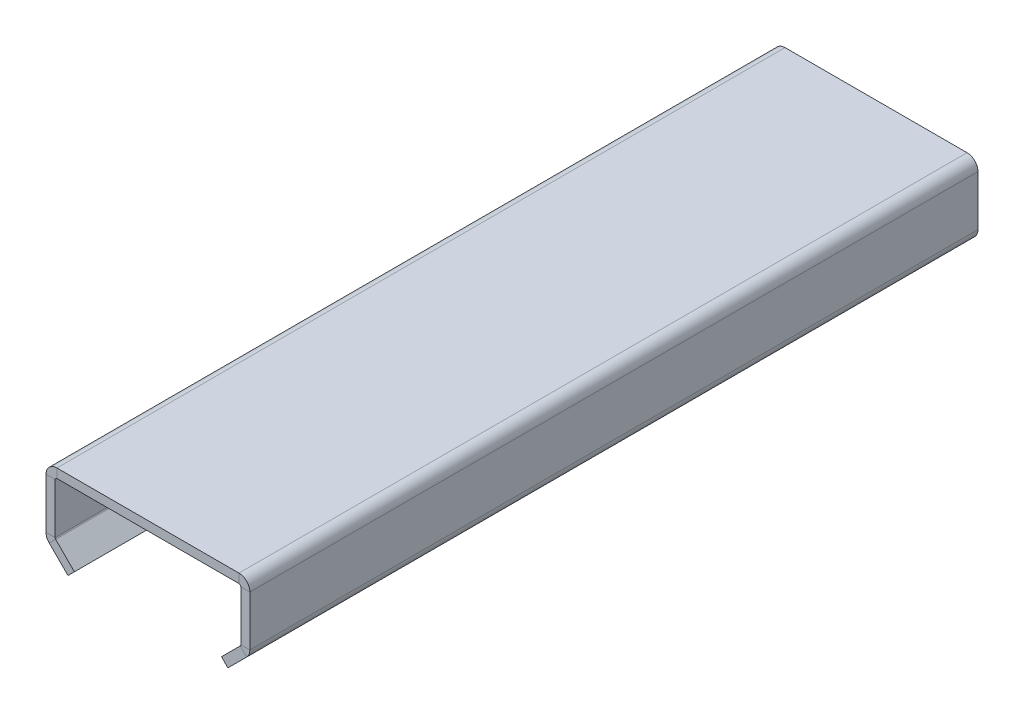
ISO-10303-21;
HEADER;
FILE_DESCRIPTION(('STEP AP214'),'2;1');
FILE_NAME('part.step','',(''),(''),'','','');
FILE_SCHEMA(('AUTOMOTIVE_DESIGN { 1 0 10303 214 1 1 1 1 }'));
ENDSEC;
DATA;
#1=APPLICATION_CONTEXT('core data for automotive mechanical design processes');
#2=APPLICATION_PROTOCOL_DEFINITION('international standard','automotive_design',2000,#1);
#3=PRODUCT_CONTEXT('',#1,'mechanical');
#4=PRODUCT('Part','Part','',(#3));
#5=PRODUCT_RELATED_PRODUCT_CATEGORY('part','',(#4));
#6=PRODUCT_DEFINITION_FORMATION('','',#4);
#7=PRODUCT_DEFINITION_CONTEXT('part definition',#1,'design');
#8=PRODUCT_DEFINITION('design','',#6,#7);
#9=PRODUCT_DEFINITION_SHAPE('','',#8);
#10=(LENGTH_UNIT() NAMED_UNIT(*) SI_UNIT(.MILLI.,.METRE.));
#11=(NAMED_UNIT(*) PLANE_ANGLE_UNIT() SI_UNIT($,.RADIAN.));
#12=(NAMED_UNIT(*) SI_UNIT($,.STERADIAN.) SOLID_ANGLE_UNIT());
#13=UNCERTAINTY_MEASURE_WITH_UNIT(LENGTH_MEASURE(1.E-05),#10,'distance_accuracy_value','');
#14=(GEOMETRIC_REPRESENTATION_CONTEXT(3) GLOBAL_UNCERTAINTY_ASSIGNED_CONTEXT((#13)) GLOBAL_UNIT_ASSIGNED_CONTEXT((#10,
#11,#12)) REPRESENTATION_CONTEXT('',''));
#15=CARTESIAN_POINT('',(0.,0.,0.));
#16=DIRECTION('',(0.,0.,1.));
#17=DIRECTION('',(1.,0.,0.));
#18=AXIS2_PLACEMENT_3D('',#15,#16,#17);
#19=CARTESIAN_POINT('',(-10.3137084989848,10.3137084989847,200.));
#20=DIRECTION('',(0.,0.,1.));
#21=DIRECTION('',(1.,0.,0.));
#22=AXIS2_PLACEMENT_3D('',#19,#20,#21);
#23=PLANE('',#22);
#24=DIRECTION('',(-0.707106781186546,-0.707106781186549,0.));
#25=VECTOR('',#24,1.);
#26=CARTESIAN_POINT('',(-10.3137084989848,10.3137084989847,200.));
#27=LINE('',#26,#25);
#28=CARTESIAN_POINT('',(-10.3137084989848,10.3137084989847,200.));
#29=VERTEX_POINT('',#28);
#30=CARTESIAN_POINT('',(-13.8492424049175,6.77817459305199,200.));
#31=VERTEX_POINT('',#30);
#32=EDGE_CURVE('E11',#29,#31,#27,.T.);
#33=ORIENTED_EDGE('',*,*,#32,.F.);
#34=CARTESIAN_POINT('',(-9.60660171779823,11.0208152801713,200.));
#35=DIRECTION('',(0.,0.,1.));
#36=DIRECTION('',(1.,0.,0.));
#37=AXIS2_PLACEMENT_3D('',#34,#35,#36);
#38=CIRCLE('',#37,1.);
#39=CARTESIAN_POINT('',(-10.6066017177982,11.0208152801713,200.));
#40=VERTEX_POINT('',#39);
#41=EDGE_CURVE('E422',#40,#29,#38,.T.);
#42=ORIENTED_EDGE('',*,*,#41,.F.);
#43=DIRECTION('',(1.,0.,0.));
#44=VECTOR('',#43,1.);
#45=CARTESIAN_POINT('',(-15.6066017177982,11.0208152801713,200.));
#46=LINE('',#45,#44);
#47=CARTESIAN_POINT('',(-15.6066017177982,11.0208152801713,200.));
#48=VERTEX_POINT('',#47);
#49=EDGE_CURVE('E53',#48,#40,#46,.T.);
#50=ORIENTED_EDGE('',*,*,#49,.F.);
#51=CARTESIAN_POINT('',(-9.60660171779823,11.0208152801713,200.));
#52=DIRECTION('',(0.,0.,1.));
#53=DIRECTION('',(1.,0.,0.));
#54=AXIS2_PLACEMENT_3D('',#51,#52,#53);
#55=CIRCLE('',#54,6.);
#56=EDGE_CURVE('E229',#48,#31,#55,.T.);
#57=ORIENTED_EDGE('',*,*,#56,.T.);
#58=EDGE_LOOP('',(#33,#42,#50,#57));
#59=FACE_BOUND('',#58,.T.);
#60=ADVANCED_FACE('F44',(#59),#23,.T.);
#61=CARTESIAN_POINT('',(-15.6066017177982,11.0208152801713,200.));
#62=DIRECTION('',(0.,0.,1.));
#63=DIRECTION('',(1.,0.,0.));
#64=AXIS2_PLACEMENT_3D('',#61,#62,#63);
#65=PLANE('',#64);
#66=DIRECTION('',(0.707106781186549,-0.707106781186546,0.));
#67=VECTOR('',#66,1.);
#68=CARTESIAN_POINT('',(0.,0.,200.));
#69=LINE('',#68,#67);
#70=CARTESIAN_POINT('',(0.,0.,200.));
#71=VERTEX_POINT('',#70);
#72=EDGE_CURVE('E427',#29,#71,#69,.T.);
#73=ORIENTED_EDGE('',*,*,#72,.F.);
#74=ORIENTED_EDGE('',*,*,#32,.T.);
#75=DIRECTION('',(0.707106781186549,-0.707106781186546,0.));
#76=VECTOR('',#75,1.);
#77=CARTESIAN_POINT('',(-3.53553390593273,-3.53553390593274,200.));
#78=LINE('',#77,#76);
#79=CARTESIAN_POINT('',(-3.53553390593273,-3.53553390593274,200.));
#80=VERTEX_POINT('',#79);
#81=EDGE_CURVE('E137',#31,#80,#78,.T.);
#82=ORIENTED_EDGE('',*,*,#81,.T.);
#83=DIRECTION('',(-0.707106781186546,-0.707106781186549,0.));
#84=VECTOR('',#83,1.);
#85=CARTESIAN_POINT('',(0.,0.,200.));
#86=LINE('',#85,#84);
#87=EDGE_CURVE('E1030',#71,#80,#86,.T.);
#88=ORIENTED_EDGE('',*,*,#87,.F.);
#89=EDGE_LOOP('',(#73,#74,#82,#88));
#90=FACE_BOUND('',#89,.T.);
#91=ADVANCED_FACE('F571',(#90),#65,.T.);
#92=CARTESIAN_POINT('',(-10.6066017177982,11.0208152801713,-200.));
#93=DIRECTION('',(0.,0.,-1.));
#94=DIRECTION('',(-1.,0.,0.));
#95=AXIS2_PLACEMENT_3D('',#92,#93,#94);
#96=PLANE('',#95);
#97=DIRECTION('',(-1.,0.,0.));
#98=VECTOR('',#97,1.);
#99=CARTESIAN_POINT('',(-10.6066017177982,11.0208152801713,-200.));
#100=LINE('',#99,#98);
#101=CARTESIAN_POINT('',(-10.6066017177982,11.0208152801713,-200.));
#102=VERTEX_POINT('',#101);
#103=CARTESIAN_POINT('',(-15.6066017177982,11.0208152801713,-200.));
#104=VERTEX_POINT('',#103);
#105=EDGE_CURVE('E124',#102,#104,#100,.T.);
#106=ORIENTED_EDGE('',*,*,#105,.F.);
#107=CARTESIAN_POINT('',(-9.60660171779823,11.0208152801713,-200.));
#108=DIRECTION('',(0.,0.,1.));
#109=DIRECTION('',(1.,0.,0.));
#110=AXIS2_PLACEMENT_3D('',#107,#108,#109);
#111=CIRCLE('',#110,1.);
#112=CARTESIAN_POINT('',(-10.3137084989848,10.3137084989847,-200.));
#113=VERTEX_POINT('',#112);
#114=EDGE_CURVE('E249',#102,#113,#111,.T.);
#115=ORIENTED_EDGE('',*,*,#114,.T.);
#116=DIRECTION('',(0.707106781186546,0.707106781186549,0.));
#117=VECTOR('',#116,1.);
#118=CARTESIAN_POINT('',(-13.8492424049175,6.77817459305199,-200.));
#119=LINE('',#118,#117);
#120=CARTESIAN_POINT('',(-13.8492424049175,6.77817459305199,-200.));
#121=VERTEX_POINT('',#120);
#122=EDGE_CURVE('E131',#121,#113,#119,.T.);
#123=ORIENTED_EDGE('',*,*,#122,.F.);
#124=CARTESIAN_POINT('',(-9.60660171779823,11.0208152801713,-200.));
#125=DIRECTION('',(0.,0.,1.));
#126=DIRECTION('',(1.,0.,0.));
#127=AXIS2_PLACEMENT_3D('',#124,#125,#126);
#128=CIRCLE('',#127,6.);
#129=EDGE_CURVE('E308',#104,#121,#128,.T.);
#130=ORIENTED_EDGE('',*,*,#129,.F.);
#131=EDGE_LOOP('',(#106,#115,#123,#130));
#132=FACE_BOUND('',#131,.T.);
#133=ADVANCED_FACE('F575',(#132),#96,.T.);
#134=CARTESIAN_POINT('',(-13.8492424049175,6.77817459305199,-200.));
#135=DIRECTION('',(0.,0.,-1.));
#136=DIRECTION('',(-1.,0.,0.));
#137=AXIS2_PLACEMENT_3D('',#134,#135,#136);
#138=PLANE('',#137);
#139=DIRECTION('',(0.,-1.,0.));
#140=VECTOR('',#139,1.);
#141=CARTESIAN_POINT('',(-10.6066017177982,10.6066017177982,-200.));
#142=LINE('',#141,#140);
#143=CARTESIAN_POINT('',(-10.6066017177982,38.6066017177982,-200.));
#144=VERTEX_POINT('',#143);
#145=EDGE_CURVE('E252',#144,#102,#142,.T.);
#146=ORIENTED_EDGE('',*,*,#145,.T.);
#147=ORIENTED_EDGE('',*,*,#105,.T.);
#148=DIRECTION('',(0.,1.,0.));
#149=VECTOR('',#148,1.);
#150=CARTESIAN_POINT('',(-15.6066017177982,10.6066017177982,-200.));
#151=LINE('',#150,#149);
#152=CARTESIAN_POINT('',(-15.6066017177982,38.6066017177982,-200.));
#153=VERTEX_POINT('',#152);
#154=EDGE_CURVE('E305',#153,#104,#151,.F.);
#155=ORIENTED_EDGE('',*,*,#154,.F.);
#156=DIRECTION('',(1.,0.,0.));
#157=VECTOR('',#156,1.);
#158=CARTESIAN_POINT('',(-15.6066017177982,38.6066017177982,-200.));
#159=LINE('',#158,#157);
#160=EDGE_CURVE('E402',#153,#144,#159,.T.);
#161=ORIENTED_EDGE('',*,*,#160,.T.);
#162=EDGE_LOOP('',(#146,#147,#155,#161));
#163=FACE_BOUND('',#162,.T.);
#164=ADVANCED_FACE('F491',(#163),#138,.T.);
#165=CARTESIAN_POINT('',(-10.6066017177982,38.6066017177982,200.));
#166=DIRECTION('',(0.,0.,1.));
#167=DIRECTION('',(1.,0.,0.));
#168=AXIS2_PLACEMENT_3D('',#165,#166,#167);
#169=PLANE('',#168);
#170=DIRECTION('',(-1.,0.,0.));
#171=VECTOR('',#170,1.);
#172=CARTESIAN_POINT('',(-10.6066017177982,38.6066017177982,200.));
#173=LINE('',#172,#171);
#174=CARTESIAN_POINT('',(-10.6066017177982,38.6066017177982,200.));
#175=VERTEX_POINT('',#174);
#176=CARTESIAN_POINT('',(-15.6066017177982,38.6066017177982,200.));
#177=VERTEX_POINT('',#176);
#178=EDGE_CURVE('E189',#175,#177,#173,.T.);
#179=ORIENTED_EDGE('',*,*,#178,.F.);
#180=CARTESIAN_POINT('',(-9.60660171779823,38.6066017177982,200.));
#181=DIRECTION('',(0.,0.,1.));
#182=DIRECTION('',(1.,0.,0.));
#183=AXIS2_PLACEMENT_3D('',#180,#181,#182);
#184=CIRCLE('',#183,1.);
#185=CARTESIAN_POINT('',(-9.60660171779823,39.6066017177982,200.));
#186=VERTEX_POINT('',#185);
#187=EDGE_CURVE('E431',#186,#175,#184,.T.);
#188=ORIENTED_EDGE('',*,*,#187,.F.);
#189=DIRECTION('',(0.,-1.,0.));
#190=VECTOR('',#189,1.);
#191=CARTESIAN_POINT('',(-9.60660171779823,44.6066017177982,200.));
#192=LINE('',#191,#190);
#193=CARTESIAN_POINT('',(-9.60660171779823,44.6066017177982,200.));
#194=VERTEX_POINT('',#193);
#195=EDGE_CURVE('E202',#194,#186,#192,.T.);
#196=ORIENTED_EDGE('',*,*,#195,.F.);
#197=CARTESIAN_POINT('',(-9.60660171779823,38.6066017177982,200.));
#198=DIRECTION('',(0.,0.,1.));
#199=DIRECTION('',(1.,0.,0.));
#200=AXIS2_PLACEMENT_3D('',#197,#198,#199);
#201=CIRCLE('',#200,6.);
#202=EDGE_CURVE('E205',#194,#177,#201,.T.);
#203=ORIENTED_EDGE('',*,*,#202,.T.);
#204=EDGE_LOOP('',(#179,#188,#196,#203));
#205=FACE_BOUND('',#204,.T.);
#206=ADVANCED_FACE('F207',(#205),#169,.T.);
#207=CARTESIAN_POINT('',(-9.60660171779823,44.6066017177982,200.));
#208=DIRECTION('',(0.,0.,1.));
#209=DIRECTION('',(1.,0.,0.));
#210=AXIS2_PLACEMENT_3D('',#207,#208,#209);
#211=PLANE('',#210);
#212=DIRECTION('',(0.,-1.,0.));
#213=VECTOR('',#212,1.);
#214=CARTESIAN_POINT('',(-10.6066017177982,10.6066017177982,200.));
#215=LINE('',#214,#213);
#216=EDGE_CURVE('E196',#175,#40,#215,.T.);
#217=ORIENTED_EDGE('',*,*,#216,.F.);
#218=ORIENTED_EDGE('',*,*,#178,.T.);
#219=DIRECTION('',(0.,1.,0.));
#220=VECTOR('',#219,1.);
#221=CARTESIAN_POINT('',(-15.6066017177982,10.6066017177982,200.));
#222=LINE('',#221,#220);
#223=EDGE_CURVE('E193',#177,#48,#222,.F.);
#224=ORIENTED_EDGE('',*,*,#223,.T.);
#225=ORIENTED_EDGE('',*,*,#49,.T.);
#226=EDGE_LOOP('',(#217,#218,#224,#225));
#227=FACE_BOUND('',#226,.T.);
#228=ADVANCED_FACE('F191',(#227),#211,.T.);
#229=CARTESIAN_POINT('',(-9.60660171779823,39.6066017177982,-200.));
#230=DIRECTION('',(0.,0.,-1.));
#231=DIRECTION('',(-1.,0.,0.));
#232=AXIS2_PLACEMENT_3D('',#229,#230,#231);
#233=PLANE('',#232);
#234=DIRECTION('',(0.,1.,0.));
#235=VECTOR('',#234,1.);
#236=CARTESIAN_POINT('',(-9.60660171779823,39.6066017177982,-200.));
#237=LINE('',#236,#235);
#238=CARTESIAN_POINT('',(-9.60660171779823,39.6066017177982,-200.));
#239=VERTEX_POINT('',#238);
#240=CARTESIAN_POINT('',(-9.60660171779823,44.6066017177982,-200.));
#241=VERTEX_POINT('',#240);
#242=EDGE_CURVE('E405',#239,#241,#237,.T.);
#243=ORIENTED_EDGE('',*,*,#242,.F.);
#244=CARTESIAN_POINT('',(-9.60660171779823,38.6066017177982,-200.));
#245=DIRECTION('',(0.,0.,1.));
#246=DIRECTION('',(1.,0.,0.));
#247=AXIS2_PLACEMENT_3D('',#244,#245,#246);
#248=CIRCLE('',#247,1.);
#249=EDGE_CURVE('E255',#239,#144,#248,.T.);
#250=ORIENTED_EDGE('',*,*,#249,.T.);
#251=ORIENTED_EDGE('',*,*,#160,.F.);
#252=CARTESIAN_POINT('',(-9.60660171779823,38.6066017177982,-200.));
#253=DIRECTION('',(0.,0.,1.));
#254=DIRECTION('',(1.,0.,0.));
#255=AXIS2_PLACEMENT_3D('',#252,#253,#254);
#256=CIRCLE('',#255,6.);
#257=EDGE_CURVE('E219',#241,#153,#256,.T.);
#258=ORIENTED_EDGE('',*,*,#257,.F.);
#259=EDGE_LOOP('',(#243,#250,#251,#258));
#260=FACE_BOUND('',#259,.T.);
#261=ADVANCED_FACE('F489',(#260),#233,.T.);
#262=CARTESIAN_POINT('',(-15.6066017177982,38.6066017177982,-200.));
#263=DIRECTION('',(0.,0.,-1.));
#264=DIRECTION('',(-1.,0.,0.));
#265=AXIS2_PLACEMENT_3D('',#262,#263,#264);
#266=PLANE('',#265);
#267=DIRECTION('',(-1.,0.,0.));
#268=VECTOR('',#267,1.);
#269=CARTESIAN_POINT('',(-10.6066017177982,39.6066017177982,-200.));
#270=LINE('',#269,#268);
#271=CARTESIAN_POINT('',(90.3933982822018,39.6066017177982,-200.));
#272=VERTEX_POINT('',#271);
#273=EDGE_CURVE('E259',#272,#239,#270,.T.);
#274=ORIENTED_EDGE('',*,*,#273,.T.);
#275=ORIENTED_EDGE('',*,*,#242,.T.);
#276=DIRECTION('',(1.,0.,0.));
#277=VECTOR('',#276,1.);
#278=CARTESIAN_POINT('',(-10.6066017177982,44.6066017177982,-200.));
#279=LINE('',#278,#277);
#280=CARTESIAN_POINT('',(90.3933982822018,44.6066017177982,-200.));
#281=VERTEX_POINT('',#280);
#282=EDGE_CURVE('E299',#281,#241,#279,.F.);
#283=ORIENTED_EDGE('',*,*,#282,.F.);
#284=DIRECTION('',(0.,-1.,0.));
#285=VECTOR('',#284,1.);
#286=CARTESIAN_POINT('',(90.3933982822018,44.6066017177982,-200.));
#287=LINE('',#286,#285);
#288=EDGE_CURVE('E390',#281,#272,#287,.T.);
#289=ORIENTED_EDGE('',*,*,#288,.T.);
#290=EDGE_LOOP('',(#274,#275,#283,#289));
#291=FACE_BOUND('',#290,.T.);
#292=ADVANCED_FACE('F550',(#291),#266,.T.);
#293=CARTESIAN_POINT('',(90.3933982822018,39.6066017177982,200.));
#294=DIRECTION('',(0.,0.,1.));
#295=DIRECTION('',(1.,0.,0.));
#296=AXIS2_PLACEMENT_3D('',#293,#294,#295);
#297=PLANE('',#296);
#298=DIRECTION('',(0.,1.,0.));
#299=VECTOR('',#298,1.);
#300=CARTESIAN_POINT('',(90.3933982822018,39.6066017177982,200.));
#301=LINE('',#300,#299);
#302=CARTESIAN_POINT('',(90.3933982822018,39.6066017177982,200.));
#303=VERTEX_POINT('',#302);
#304=CARTESIAN_POINT('',(90.3933982822018,44.6066017177982,200.));
#305=VERTEX_POINT('',#304);
#306=EDGE_CURVE('E399',#303,#305,#301,.T.);
#307=ORIENTED_EDGE('',*,*,#306,.F.);
#308=CARTESIAN_POINT('',(90.3933982822018,38.6066017177982,200.));
#309=DIRECTION('',(0.,0.,1.));
#310=DIRECTION('',(1.,0.,0.));
#311=AXIS2_PLACEMENT_3D('',#308,#309,#310);
#312=CIRCLE('',#311,1.);
#313=CARTESIAN_POINT('',(91.3933982822018,38.6066017177982,200.));
#314=VERTEX_POINT('',#313);
#315=EDGE_CURVE('E442',#314,#303,#312,.T.);
#316=ORIENTED_EDGE('',*,*,#315,.F.);
#317=DIRECTION('',(-1.,0.,0.));
#318=VECTOR('',#317,1.);
#319=CARTESIAN_POINT('',(96.3933982822018,38.6066017177982,200.));
#320=LINE('',#319,#318);
#321=CARTESIAN_POINT('',(96.3933982822018,38.6066017177982,200.));
#322=VERTEX_POINT('',#321);
#323=EDGE_CURVE('E396',#322,#314,#320,.T.);
#324=ORIENTED_EDGE('',*,*,#323,.F.);
#325=CARTESIAN_POINT('',(90.3933982822018,38.6066017177982,200.));
#326=DIRECTION('',(0.,0.,1.));
#327=DIRECTION('',(1.,0.,0.));
#328=AXIS2_PLACEMENT_3D('',#325,#326,#327);
#329=CIRCLE('',#328,6.);
#330=EDGE_CURVE('E474',#322,#305,#329,.T.);
#331=ORIENTED_EDGE('',*,*,#330,.T.);
#332=EDGE_LOOP('',(#307,#316,#324,#331));
#333=FACE_BOUND('',#332,.T.);
#334=ADVANCED_FACE('F504',(#333),#297,.T.);
#335=CARTESIAN_POINT('',(96.3933982822018,38.6066017177982,200.));
#336=DIRECTION('',(0.,0.,1.));
#337=DIRECTION('',(1.,0.,0.));
#338=AXIS2_PLACEMENT_3D('',#335,#336,#337);
#339=PLANE('',#338);
#340=DIRECTION('',(-1.,0.,0.));
#341=VECTOR('',#340,1.);
#342=CARTESIAN_POINT('',(-10.6066017177982,39.6066017177982,200.));
#343=LINE('',#342,#341);
#344=EDGE_CURVE('E435',#303,#186,#343,.T.);
#345=ORIENTED_EDGE('',*,*,#344,.F.);
#346=ORIENTED_EDGE('',*,*,#306,.T.);
#347=DIRECTION('',(1.,0.,0.));
#348=VECTOR('',#347,1.);
#349=CARTESIAN_POINT('',(-10.6066017177982,44.6066017177982,200.));
#350=LINE('',#349,#348);
#351=EDGE_CURVE('E212',#305,#194,#350,.F.);
#352=ORIENTED_EDGE('',*,*,#351,.T.);
#353=ORIENTED_EDGE('',*,*,#195,.T.);
#354=EDGE_LOOP('',(#345,#346,#352,#353));
#355=FACE_BOUND('',#354,.T.);
#356=ADVANCED_FACE('F483',(#355),#339,.T.);
#357=CARTESIAN_POINT('',(91.3933982822018,38.6066017177982,-200.));
#358=DIRECTION('',(0.,0.,-1.));
#359=DIRECTION('',(-1.,0.,0.));
#360=AXIS2_PLACEMENT_3D('',#357,#358,#359);
#361=PLANE('',#360);
#362=DIRECTION('',(1.,0.,0.));
#363=VECTOR('',#362,1.);
#364=CARTESIAN_POINT('',(91.3933982822018,38.6066017177982,-200.));
#365=LINE('',#364,#363);
#366=CARTESIAN_POINT('',(91.3933982822018,38.6066017177982,-200.));
#367=VERTEX_POINT('',#366);
#368=CARTESIAN_POINT('',(96.3933982822018,38.6066017177982,-200.));
#369=VERTEX_POINT('',#368);
#370=EDGE_CURVE('E393',#367,#369,#365,.T.);
#371=ORIENTED_EDGE('',*,*,#370,.F.);
#372=CARTESIAN_POINT('',(90.3933982822018,38.6066017177982,-200.));
#373=DIRECTION('',(0.,0.,1.));
#374=DIRECTION('',(1.,0.,0.));
#375=AXIS2_PLACEMENT_3D('',#372,#373,#374);
#376=CIRCLE('',#375,1.);
#377=EDGE_CURVE('E263',#367,#272,#376,.T.);
#378=ORIENTED_EDGE('',*,*,#377,.T.);
#379=ORIENTED_EDGE('',*,*,#288,.F.);
#380=CARTESIAN_POINT('',(90.3933982822018,38.6066017177982,-200.));
#381=DIRECTION('',(0.,0.,1.));
#382=DIRECTION('',(1.,0.,0.));
#383=AXIS2_PLACEMENT_3D('',#380,#381,#382);
#384=CIRCLE('',#383,6.);
#385=EDGE_CURVE('E295',#369,#281,#384,.T.);
#386=ORIENTED_EDGE('',*,*,#385,.F.);
#387=EDGE_LOOP('',(#371,#378,#379,#386));
#388=FACE_BOUND('',#387,.T.);
#389=ADVANCED_FACE('F552',(#388),#361,.T.);
#390=CARTESIAN_POINT('',(90.3933982822018,44.6066017177982,-200.));
#391=DIRECTION('',(0.,0.,-1.));
#392=DIRECTION('',(-1.,0.,0.));
#393=AXIS2_PLACEMENT_3D('',#390,#391,#392);
#394=PLANE('',#393);
#395=DIRECTION('',(0.,1.,0.));
#396=VECTOR('',#395,1.);
#397=CARTESIAN_POINT('',(91.3933982822018,10.6066017177982,-200.));
#398=LINE('',#397,#396);
#399=CARTESIAN_POINT('',(91.3933982822018,11.0208152801713,-200.));
#400=VERTEX_POINT('',#399);
#401=EDGE_CURVE('E267',#400,#367,#398,.T.);
#402=ORIENTED_EDGE('',*,*,#401,.T.);
#403=ORIENTED_EDGE('',*,*,#370,.T.);
#404=DIRECTION('',(0.,1.,0.));
#405=VECTOR('',#404,1.);
#406=CARTESIAN_POINT('',(96.3933982822018,10.6066017177982,-200.));
#407=LINE('',#406,#405);
#408=CARTESIAN_POINT('',(96.3933982822018,11.0208152801713,-200.));
#409=VERTEX_POINT('',#408);
#410=EDGE_CURVE('E291',#409,#369,#407,.T.);
#411=ORIENTED_EDGE('',*,*,#410,.F.);
#412=DIRECTION('',(-1.,0.,0.));
#413=VECTOR('',#412,1.);
#414=CARTESIAN_POINT('',(96.3933982822018,11.0208152801713,-200.));
#415=LINE('',#414,#413);
#416=EDGE_CURVE('E378',#409,#400,#415,.T.);
#417=ORIENTED_EDGE('',*,*,#416,.T.);
#418=EDGE_LOOP('',(#402,#403,#411,#417));
#419=FACE_BOUND('',#418,.T.);
#420=ADVANCED_FACE('F554',(#419),#394,.T.);
#421=CARTESIAN_POINT('',(91.3933982822018,11.0208152801713,200.));
#422=DIRECTION('',(0.,0.,1.));
#423=DIRECTION('',(1.,0.,0.));
#424=AXIS2_PLACEMENT_3D('',#421,#422,#423);
#425=PLANE('',#424);
#426=DIRECTION('',(1.,0.,0.));
#427=VECTOR('',#426,1.);
#428=CARTESIAN_POINT('',(91.3933982822018,11.0208152801713,200.));
#429=LINE('',#428,#427);
#430=CARTESIAN_POINT('',(91.3933982822018,11.0208152801713,200.));
#431=VERTEX_POINT('',#430);
#432=CARTESIAN_POINT('',(96.3933982822018,11.0208152801713,200.));
#433=VERTEX_POINT('',#432);
#434=EDGE_CURVE('E387',#431,#433,#429,.T.);
#435=ORIENTED_EDGE('',*,*,#434,.F.);
#436=CARTESIAN_POINT('',(90.3933982822018,11.0208152801713,200.));
#437=DIRECTION('',(0.,0.,1.));
#438=DIRECTION('',(1.,0.,0.));
#439=AXIS2_PLACEMENT_3D('',#436,#437,#438);
#440=CIRCLE('',#439,1.);
#441=CARTESIAN_POINT('',(91.1005050633883,10.3137084989848,200.));
#442=VERTEX_POINT('',#441);
#443=EDGE_CURVE('E450',#442,#431,#440,.T.);
#444=ORIENTED_EDGE('',*,*,#443,.F.);
#445=DIRECTION('',(-0.707106781186547,0.707106781186548,0.));
#446=VECTOR('',#445,1.);
#447=CARTESIAN_POINT('',(94.636038969321,6.77817459305201,200.));
#448=LINE('',#447,#446);
#449=CARTESIAN_POINT('',(94.636038969321,6.77817459305201,200.));
#450=VERTEX_POINT('',#449);
#451=EDGE_CURVE('E384',#450,#442,#448,.T.);
#452=ORIENTED_EDGE('',*,*,#451,.F.);
#453=CARTESIAN_POINT('',(90.3933982822018,11.0208152801713,200.));
#454=DIRECTION('',(0.,0.,1.));
#455=DIRECTION('',(1.,0.,0.));
#456=AXIS2_PLACEMENT_3D('',#453,#454,#455);
#457=CIRCLE('',#456,6.);
#458=EDGE_CURVE('E466',#450,#433,#457,.T.);
#459=ORIENTED_EDGE('',*,*,#458,.T.);
#460=EDGE_LOOP('',(#435,#444,#452,#459));
#461=FACE_BOUND('',#460,.T.);
#462=ADVANCED_FACE('F518',(#461),#425,.T.);
#463=CARTESIAN_POINT('',(94.636038969321,6.77817459305201,200.));
#464=DIRECTION('',(0.,0.,1.));
#465=DIRECTION('',(1.,0.,0.));
#466=AXIS2_PLACEMENT_3D('',#463,#464,#465);
#467=PLANE('',#466);
#468=DIRECTION('',(0.,1.,0.));
#469=VECTOR('',#468,1.);
#470=CARTESIAN_POINT('',(91.3933982822018,10.6066017177982,200.));
#471=LINE('',#470,#469);
#472=EDGE_CURVE('E446',#431,#314,#471,.T.);
#473=ORIENTED_EDGE('',*,*,#472,.F.);
#474=ORIENTED_EDGE('',*,*,#434,.T.);
#475=DIRECTION('',(0.,1.,0.));
#476=VECTOR('',#475,1.);
#477=CARTESIAN_POINT('',(96.3933982822018,10.6066017177982,200.));
#478=LINE('',#477,#476);
#479=EDGE_CURVE('E470',#433,#322,#478,.T.);
#480=ORIENTED_EDGE('',*,*,#479,.T.);
#481=ORIENTED_EDGE('',*,*,#323,.T.);
#482=EDGE_LOOP('',(#473,#474,#480,#481));
#483=FACE_BOUND('',#482,.T.);
#484=ADVANCED_FACE('F511',(#483),#467,.T.);
#485=CARTESIAN_POINT('',(91.1005050633883,10.3137084989848,-200.));
#486=DIRECTION('',(0.,0.,-1.));
#487=DIRECTION('',(-1.,0.,0.));
#488=AXIS2_PLACEMENT_3D('',#485,#486,#487);
#489=PLANE('',#488);
#490=DIRECTION('',(0.707106781186547,-0.707106781186548,0.));
#491=VECTOR('',#490,1.);
#492=CARTESIAN_POINT('',(91.1005050633883,10.3137084989848,-200.));
#493=LINE('',#492,#491);
#494=CARTESIAN_POINT('',(91.1005050633883,10.3137084989848,-200.));
#495=VERTEX_POINT('',#494);
#496=CARTESIAN_POINT('',(94.636038969321,6.77817459305201,-200.));
#497=VERTEX_POINT('',#496);
#498=EDGE_CURVE('E381',#495,#497,#493,.T.);
#499=ORIENTED_EDGE('',*,*,#498,.F.);
#500=CARTESIAN_POINT('',(90.3933982822018,11.0208152801713,-200.));
#501=DIRECTION('',(0.,0.,1.));
#502=DIRECTION('',(1.,0.,0.));
#503=AXIS2_PLACEMENT_3D('',#500,#501,#502);
#504=CIRCLE('',#503,1.);
#505=EDGE_CURVE('E271',#495,#400,#504,.T.);
#506=ORIENTED_EDGE('',*,*,#505,.T.);
#507=ORIENTED_EDGE('',*,*,#416,.F.);
#508=CARTESIAN_POINT('',(90.3933982822018,11.0208152801713,-200.));
#509=DIRECTION('',(0.,0.,1.));
#510=DIRECTION('',(1.,0.,0.));
#511=AXIS2_PLACEMENT_3D('',#508,#509,#510);
#512=CIRCLE('',#511,6.);
#513=EDGE_CURVE('E287',#497,#409,#512,.T.);
#514=ORIENTED_EDGE('',*,*,#513,.F.);
#515=EDGE_LOOP('',(#499,#506,#507,#514));
#516=FACE_BOUND('',#515,.T.);
#517=ADVANCED_FACE('F556',(#516),#489,.T.);
#518=CARTESIAN_POINT('',(96.3933982822018,11.0208152801713,-200.));
#519=DIRECTION('',(0.,0.,-1.));
#520=DIRECTION('',(-1.,0.,0.));
#521=AXIS2_PLACEMENT_3D('',#518,#519,#520);
#522=PLANE('',#521);
#523=DIRECTION('',(0.707106781186549,0.707106781186546,0.));
#524=VECTOR('',#523,1.);
#525=CARTESIAN_POINT('',(80.7867965644035,0.,-200.));
#526=LINE('',#525,#524);
#527=CARTESIAN_POINT('',(80.7867965644035,0.,-200.));
#528=VERTEX_POINT('',#527);
#529=EDGE_CURVE('E275',#528,#495,#526,.T.);
#530=ORIENTED_EDGE('',*,*,#529,.T.);
#531=ORIENTED_EDGE('',*,*,#498,.T.);
#532=DIRECTION('',(0.707106781186549,0.707106781186546,0.));
#533=VECTOR('',#532,1.);
#534=CARTESIAN_POINT('',(84.3223304703363,-3.53553390593272,-200.));
#535=LINE('',#534,#533);
#536=CARTESIAN_POINT('',(84.3223304703363,-3.53553390593272,-200.));
#537=VERTEX_POINT('',#536);
#538=EDGE_CURVE('E283',#537,#497,#535,.T.);
#539=ORIENTED_EDGE('',*,*,#538,.F.);
#540=DIRECTION('',(-0.707106781186545,0.70710678118655,0.));
#541=VECTOR('',#540,1.);
#542=CARTESIAN_POINT('',(84.3223304703363,-3.53553390593272,-200.));
#543=LINE('',#542,#541);
#544=EDGE_CURVE('E279',#537,#528,#543,.T.);
#545=ORIENTED_EDGE('',*,*,#544,.T.);
#546=EDGE_LOOP('',(#530,#531,#539,#545));
#547=FACE_BOUND('',#546,.T.);
#548=ADVANCED_FACE('F558',(#547),#522,.T.);
#549=CARTESIAN_POINT('',(-3.53553390593273,-3.53553390593274,200.));
#550=DIRECTION('',(0.707106781186546,0.707106781186549,0.));
#551=DIRECTION('',(-0.707106781186549,0.707106781186546,0.));
#552=AXIS2_PLACEMENT_3D('',#549,#550,#551);
#553=PLANE('',#552);
#554=DIRECTION('',(0.707106781186549,-0.707106781186546,0.));
#555=VECTOR('',#554,1.);
#556=CARTESIAN_POINT('',(-3.53553390593273,-3.53553390593274,-200.));
#557=LINE('',#556,#555);
#558=CARTESIAN_POINT('',(-3.53553390593273,-3.53553390593274,-200.));
#559=VERTEX_POINT('',#558);
#560=EDGE_CURVE('E237',#121,#559,#557,.T.);
#561=ORIENTED_EDGE('',*,*,#560,.T.);
#562=DIRECTION('',(0.,0.,-1.));
#563=VECTOR('',#562,1.);
#564=CARTESIAN_POINT('',(-3.53553390593273,-3.53553390593274,200.));
#565=LINE('',#564,#563);
#566=EDGE_CURVE('E375',#80,#559,#565,.T.);
#567=ORIENTED_EDGE('',*,*,#566,.F.);
#568=ORIENTED_EDGE('',*,*,#81,.F.);
#569=DIRECTION('',(0.,0.,-1.));
#570=VECTOR('',#569,1.);
#571=CARTESIAN_POINT('',(-13.8492424049175,6.77817459305199,200.));
#572=LINE('',#571,#570);
#573=EDGE_CURVE('E233',#31,#121,#572,.T.);
#574=ORIENTED_EDGE('',*,*,#573,.T.);
#575=EDGE_LOOP('',(#561,#567,#568,#574));
#576=FACE_BOUND('',#575,.T.);
#577=ADVANCED_FACE('F560',(#576),#553,.F.);
#578=CARTESIAN_POINT('',(0.,0.,200.));
#579=DIRECTION('',(0.707106781186549,-0.707106781186546,0.));
#580=DIRECTION('',(0.707106781186546,0.707106781186549,0.));
#581=AXIS2_PLACEMENT_3D('',#578,#579,#580);
#582=PLANE('',#581);
#583=DIRECTION('',(-0.707106781186546,-0.707106781186549,0.));
#584=VECTOR('',#583,1.);
#585=CARTESIAN_POINT('',(0.,0.,-200.));
#586=LINE('',#585,#584);
#587=CARTESIAN_POINT('',(0.,0.,-200.));
#588=VERTEX_POINT('',#587);
#589=EDGE_CURVE('E241',#588,#559,#586,.T.);
#590=ORIENTED_EDGE('',*,*,#589,.F.);
#591=DIRECTION('',(0.,0.,-1.));
#592=VECTOR('',#591,1.);
#593=CARTESIAN_POINT('',(0.,0.,200.));
#594=LINE('',#593,#592);
#595=EDGE_CURVE('E372',#71,#588,#594,.T.);
#596=ORIENTED_EDGE('',*,*,#595,.F.);
#597=ORIENTED_EDGE('',*,*,#87,.T.);
#598=ORIENTED_EDGE('',*,*,#566,.T.);
#599=EDGE_LOOP('',(#590,#596,#597,#598));
#600=FACE_BOUND('',#599,.T.);
#601=ADVANCED_FACE('F566',(#600),#582,.T.);
#602=CARTESIAN_POINT('',(0.,0.,200.));
#603=DIRECTION('',(0.707106781186546,0.707106781186549,0.));
#604=DIRECTION('',(-0.707106781186549,0.707106781186546,0.));
#605=AXIS2_PLACEMENT_3D('',#602,#603,#604);
#606=PLANE('',#605);
#607=DIRECTION('',(0.707106781186549,-0.707106781186546,0.));
#608=VECTOR('',#607,1.);
#609=CARTESIAN_POINT('',(0.,0.,-200.));
#610=LINE('',#609,#608);
#611=EDGE_CURVE('E245',#113,#588,#610,.T.);
#612=ORIENTED_EDGE('',*,*,#611,.F.);
#613=DIRECTION('',(0.,0.,-1.));
#614=VECTOR('',#613,1.);
#615=CARTESIAN_POINT('',(-10.3137084989848,10.3137084989847,200.));
#616=LINE('',#615,#614);
#617=EDGE_CURVE('E368',#29,#113,#616,.T.);
#618=ORIENTED_EDGE('',*,*,#617,.F.);
#619=ORIENTED_EDGE('',*,*,#72,.T.);
#620=ORIENTED_EDGE('',*,*,#595,.T.);
#621=EDGE_LOOP('',(#612,#618,#619,#620));
#622=FACE_BOUND('',#621,.T.);
#623=ADVANCED_FACE('F632',(#622),#606,.T.);
#624=CARTESIAN_POINT('',(-9.60660171779823,11.0208152801713,200.));
#625=DIRECTION('',(0.,0.,-1.));
#626=DIRECTION('',(-1.,0.,0.));
#627=AXIS2_PLACEMENT_3D('',#624,#625,#626);
#628=CYLINDRICAL_SURFACE('',#627,1.);
#629=ORIENTED_EDGE('',*,*,#114,.F.);
#630=DIRECTION('',(0.,0.,-1.));
#631=VECTOR('',#630,1.);
#632=CARTESIAN_POINT('',(-10.6066017177982,11.0208152801713,200.));
#633=LINE('',#632,#631);
#634=EDGE_CURVE('E364',#40,#102,#633,.T.);
#635=ORIENTED_EDGE('',*,*,#634,.F.);
#636=ORIENTED_EDGE('',*,*,#41,.T.);
#637=ORIENTED_EDGE('',*,*,#617,.T.);
#638=EDGE_LOOP('',(#629,#635,#636,#637));
#639=FACE_BOUND('',#638,.T.);
#640=ADVANCED_FACE('F421',(#639),#628,.F.);
#641=CARTESIAN_POINT('',(-10.6066017177982,10.6066017177982,200.));
#642=DIRECTION('',(1.,0.,0.));
#643=DIRECTION('',(0.,0.,-1.));
#644=AXIS2_PLACEMENT_3D('',#641,#642,#643);
#645=PLANE('',#644);
#646=ORIENTED_EDGE('',*,*,#145,.F.);
#647=DIRECTION('',(0.,0.,-1.));
#648=VECTOR('',#647,1.);
#649=CARTESIAN_POINT('',(-10.6066017177982,38.6066017177982,200.));
#650=LINE('',#649,#648);
#651=EDGE_CURVE('E360',#175,#144,#650,.T.);
#652=ORIENTED_EDGE('',*,*,#651,.F.);
#653=ORIENTED_EDGE('',*,*,#216,.T.);
#654=ORIENTED_EDGE('',*,*,#634,.T.);
#655=EDGE_LOOP('',(#646,#652,#653,#654));
#656=FACE_BOUND('',#655,.T.);
#657=ADVANCED_FACE('F429',(#656),#645,.T.);
#658=CARTESIAN_POINT('',(-9.60660171779823,38.6066017177982,200.));
#659=DIRECTION('',(0.,0.,-1.));
#660=DIRECTION('',(-1.,0.,0.));
#661=AXIS2_PLACEMENT_3D('',#658,#659,#660);
#662=CYLINDRICAL_SURFACE('',#661,1.);
#663=ORIENTED_EDGE('',*,*,#249,.F.);
#664=DIRECTION('',(0.,0.,-1.));
#665=VECTOR('',#664,1.);
#666=CARTESIAN_POINT('',(-9.60660171779823,39.6066017177982,200.));
#667=LINE('',#666,#665);
#668=EDGE_CURVE('E356',#186,#239,#667,.T.);
#669=ORIENTED_EDGE('',*,*,#668,.F.);
#670=ORIENTED_EDGE('',*,*,#187,.T.);
#671=ORIENTED_EDGE('',*,*,#651,.T.);
#672=EDGE_LOOP('',(#663,#669,#670,#671));
#673=FACE_BOUND('',#672,.T.);
#674=ADVANCED_FACE('F493',(#673),#662,.F.);
#675=CARTESIAN_POINT('',(-10.6066017177982,39.6066017177982,200.));
#676=DIRECTION('',(0.,-1.,0.));
#677=DIRECTION('',(0.,0.,-1.));
#678=AXIS2_PLACEMENT_3D('',#675,#676,#677);
#679=PLANE('',#678);
#680=ORIENTED_EDGE('',*,*,#273,.F.);
#681=DIRECTION('',(0.,0.,-1.));
#682=VECTOR('',#681,1.);
#683=CARTESIAN_POINT('',(90.3933982822018,39.6066017177982,200.));
#684=LINE('',#683,#682);
#685=EDGE_CURVE('E352',#303,#272,#684,.T.);
#686=ORIENTED_EDGE('',*,*,#685,.F.);
#687=ORIENTED_EDGE('',*,*,#344,.T.);
#688=ORIENTED_EDGE('',*,*,#668,.T.);
#689=EDGE_LOOP('',(#680,#686,#687,#688));
#690=FACE_BOUND('',#689,.T.);
#691=ADVANCED_FACE('F497',(#690),#679,.T.);
#692=CARTESIAN_POINT('',(90.3933982822018,38.6066017177982,200.));
#693=DIRECTION('',(0.,0.,-1.));
#694=DIRECTION('',(-1.,0.,0.));
#695=AXIS2_PLACEMENT_3D('',#692,#693,#694);
#696=CYLINDRICAL_SURFACE('',#695,1.);
#697=ORIENTED_EDGE('',*,*,#377,.F.);
#698=DIRECTION('',(0.,0.,-1.));
#699=VECTOR('',#698,1.);
#700=CARTESIAN_POINT('',(91.3933982822018,38.6066017177982,200.));
#701=LINE('',#700,#699);
#702=EDGE_CURVE('E348',#314,#367,#701,.T.);
#703=ORIENTED_EDGE('',*,*,#702,.F.);
#704=ORIENTED_EDGE('',*,*,#315,.T.);
#705=ORIENTED_EDGE('',*,*,#685,.T.);
#706=EDGE_LOOP('',(#697,#703,#704,#705));
#707=FACE_BOUND('',#706,.T.);
#708=ADVANCED_FACE('F502',(#707),#696,.F.);
#709=CARTESIAN_POINT('',(91.3933982822018,10.6066017177982,200.));
#710=DIRECTION('',(-1.,0.,0.));
#711=DIRECTION('',(0.,0.,1.));
#712=AXIS2_PLACEMENT_3D('',#709,#710,#711);
#713=PLANE('',#712);
#714=ORIENTED_EDGE('',*,*,#401,.F.);
#715=DIRECTION('',(0.,0.,-1.));
#716=VECTOR('',#715,1.);
#717=CARTESIAN_POINT('',(91.3933982822018,11.0208152801713,200.));
#718=LINE('',#717,#716);
#719=EDGE_CURVE('E344',#431,#400,#718,.T.);
#720=ORIENTED_EDGE('',*,*,#719,.F.);
#721=ORIENTED_EDGE('',*,*,#472,.T.);
#722=ORIENTED_EDGE('',*,*,#702,.T.);
#723=EDGE_LOOP('',(#714,#720,#721,#722));
#724=FACE_BOUND('',#723,.T.);
#725=ADVANCED_FACE('F509',(#724),#713,.T.);
#726=CARTESIAN_POINT('',(90.3933982822018,11.0208152801713,200.));
#727=DIRECTION('',(0.,0.,-1.));
#728=DIRECTION('',(-1.,0.,0.));
#729=AXIS2_PLACEMENT_3D('',#726,#727,#728);
#730=CYLINDRICAL_SURFACE('',#729,1.);
#731=ORIENTED_EDGE('',*,*,#505,.F.);
#732=DIRECTION('',(0.,0.,-1.));
#733=VECTOR('',#732,1.);
#734=CARTESIAN_POINT('',(91.1005050633883,10.3137084989848,200.));
#735=LINE('',#734,#733);
#736=EDGE_CURVE('E340',#442,#495,#735,.T.);
#737=ORIENTED_EDGE('',*,*,#736,.F.);
#738=ORIENTED_EDGE('',*,*,#443,.T.);
#739=ORIENTED_EDGE('',*,*,#719,.T.);
#740=EDGE_LOOP('',(#731,#737,#738,#739));
#741=FACE_BOUND('',#740,.T.);
#742=ADVANCED_FACE('F516',(#741),#730,.F.);
#743=CARTESIAN_POINT('',(80.7867965644035,0.,200.));
#744=DIRECTION('',(-0.707106781186546,0.707106781186549,0.));
#745=DIRECTION('',(-0.707106781186549,-0.707106781186546,0.));
#746=AXIS2_PLACEMENT_3D('',#743,#744,#745);
#747=PLANE('',#746);
#748=ORIENTED_EDGE('',*,*,#529,.F.);
#749=DIRECTION('',(0.,0.,-1.));
#750=VECTOR('',#749,1.);
#751=CARTESIAN_POINT('',(80.7867965644035,0.,200.));
#752=LINE('',#751,#750);
#753=CARTESIAN_POINT('',(80.7867965644035,0.,200.));
#754=VERTEX_POINT('',#753);
#755=EDGE_CURVE('E337',#754,#528,#752,.T.);
#756=ORIENTED_EDGE('',*,*,#755,.F.);
#757=DIRECTION('',(0.707106781186549,0.707106781186546,0.));
#758=VECTOR('',#757,1.);
#759=CARTESIAN_POINT('',(80.7867965644035,0.,200.));
#760=LINE('',#759,#758);
#761=EDGE_CURVE('E454',#754,#442,#760,.T.);
#762=ORIENTED_EDGE('',*,*,#761,.T.);
#763=ORIENTED_EDGE('',*,*,#736,.T.);
#764=EDGE_LOOP('',(#748,#756,#762,#763));
#765=FACE_BOUND('',#764,.T.);
#766=ADVANCED_FACE('F522',(#765),#747,.T.);
#767=CARTESIAN_POINT('',(84.3223304703363,-3.53553390593272,200.));
#768=DIRECTION('',(-0.70710678118655,-0.707106781186545,0.));
#769=DIRECTION('',(0.707106781186545,-0.70710678118655,0.));
#770=AXIS2_PLACEMENT_3D('',#767,#768,#769);
#771=PLANE('',#770);
#772=ORIENTED_EDGE('',*,*,#544,.F.);
#773=DIRECTION('',(0.,0.,-1.));
#774=VECTOR('',#773,1.);
#775=CARTESIAN_POINT('',(84.3223304703363,-3.53553390593272,200.));
#776=LINE('',#775,#774);
#777=CARTESIAN_POINT('',(84.3223304703363,-3.53553390593272,200.));
#778=VERTEX_POINT('',#777);
#779=EDGE_CURVE('E334',#778,#537,#776,.T.);
#780=ORIENTED_EDGE('',*,*,#779,.F.);
#781=DIRECTION('',(-0.707106781186545,0.70710678118655,0.));
#782=VECTOR('',#781,1.);
#783=CARTESIAN_POINT('',(84.3223304703363,-3.53553390593272,200.));
#784=LINE('',#783,#782);
#785=EDGE_CURVE('E458',#778,#754,#784,.T.);
#786=ORIENTED_EDGE('',*,*,#785,.T.);
#787=ORIENTED_EDGE('',*,*,#755,.T.);
#788=EDGE_LOOP('',(#772,#780,#786,#787));
#789=FACE_BOUND('',#788,.T.);
#790=ADVANCED_FACE('F528',(#789),#771,.T.);
#791=CARTESIAN_POINT('',(84.3223304703363,-3.53553390593272,200.));
#792=DIRECTION('',(-0.707106781186546,0.707106781186549,0.));
#793=DIRECTION('',(-0.707106781186549,-0.707106781186546,0.));
#794=AXIS2_PLACEMENT_3D('',#791,#792,#793);
#795=PLANE('',#794);
#796=ORIENTED_EDGE('',*,*,#538,.T.);
#797=DIRECTION('',(0.,0.,-1.));
#798=VECTOR('',#797,1.);
#799=CARTESIAN_POINT('',(94.636038969321,6.77817459305201,200.));
#800=LINE('',#799,#798);
#801=EDGE_CURVE('E330',#450,#497,#800,.T.);
#802=ORIENTED_EDGE('',*,*,#801,.F.);
#803=DIRECTION('',(0.707106781186549,0.707106781186546,0.));
#804=VECTOR('',#803,1.);
#805=CARTESIAN_POINT('',(84.3223304703363,-3.53553390593272,200.));
#806=LINE('',#805,#804);
#807=EDGE_CURVE('E462',#778,#450,#806,.T.);
#808=ORIENTED_EDGE('',*,*,#807,.F.);
#809=ORIENTED_EDGE('',*,*,#779,.T.);
#810=EDGE_LOOP('',(#796,#802,#808,#809));
#811=FACE_BOUND('',#810,.T.);
#812=ADVANCED_FACE('F533',(#811),#795,.F.);
#813=CARTESIAN_POINT('',(90.3933982822018,11.0208152801713,200.));
#814=DIRECTION('',(0.,0.,-1.));
#815=DIRECTION('',(-1.,0.,0.));
#816=AXIS2_PLACEMENT_3D('',#813,#814,#815);
#817=CYLINDRICAL_SURFACE('',#816,6.);
#818=ORIENTED_EDGE('',*,*,#513,.T.);
#819=DIRECTION('',(0.,0.,-1.));
#820=VECTOR('',#819,1.);
#821=CARTESIAN_POINT('',(96.3933982822018,11.0208152801713,200.));
#822=LINE('',#821,#820);
#823=EDGE_CURVE('E326',#433,#409,#822,.T.);
#824=ORIENTED_EDGE('',*,*,#823,.F.);
#825=ORIENTED_EDGE('',*,*,#458,.F.);
#826=ORIENTED_EDGE('',*,*,#801,.T.);
#827=EDGE_LOOP('',(#818,#824,#825,#826));
#828=FACE_BOUND('',#827,.T.);
#829=ADVANCED_FACE('F538',(#828),#817,.T.);
#830=CARTESIAN_POINT('',(96.3933982822018,10.6066017177982,200.));
#831=DIRECTION('',(-1.,0.,0.));
#832=DIRECTION('',(0.,0.,1.));
#833=AXIS2_PLACEMENT_3D('',#830,#831,#832);
#834=PLANE('',#833);
#835=ORIENTED_EDGE('',*,*,#410,.T.);
#836=DIRECTION('',(0.,0.,-1.));
#837=VECTOR('',#836,1.);
#838=CARTESIAN_POINT('',(96.3933982822018,38.6066017177982,200.));
#839=LINE('',#838,#837);
#840=EDGE_CURVE('E322',#322,#369,#839,.T.);
#841=ORIENTED_EDGE('',*,*,#840,.F.);
#842=ORIENTED_EDGE('',*,*,#479,.F.);
#843=ORIENTED_EDGE('',*,*,#823,.T.);
#844=EDGE_LOOP('',(#835,#841,#842,#843));
#845=FACE_BOUND('',#844,.T.);
#846=ADVANCED_FACE('F543',(#845),#834,.F.);
#847=CARTESIAN_POINT('',(90.3933982822018,38.6066017177982,200.));
#848=DIRECTION('',(0.,0.,-1.));
#849=DIRECTION('',(-1.,0.,0.));
#850=AXIS2_PLACEMENT_3D('',#847,#848,#849);
#851=CYLINDRICAL_SURFACE('',#850,6.);
#852=ORIENTED_EDGE('',*,*,#385,.T.);
#853=DIRECTION('',(0.,0.,-1.));
#854=VECTOR('',#853,1.);
#855=CARTESIAN_POINT('',(90.3933982822018,44.6066017177982,200.));
#856=LINE('',#855,#854);
#857=EDGE_CURVE('E318',#305,#281,#856,.T.);
#858=ORIENTED_EDGE('',*,*,#857,.F.);
#859=ORIENTED_EDGE('',*,*,#330,.F.);
#860=ORIENTED_EDGE('',*,*,#840,.T.);
#861=EDGE_LOOP('',(#852,#858,#859,#860));
#862=FACE_BOUND('',#861,.T.);
#863=ADVANCED_FACE('F548',(#862),#851,.T.);
#864=CARTESIAN_POINT('',(-10.6066017177982,44.6066017177982,200.));
#865=DIRECTION('',(0.,-1.,0.));
#866=DIRECTION('',(0.,0.,-1.));
#867=AXIS2_PLACEMENT_3D('',#864,#865,#866);
#868=PLANE('',#867);
#869=ORIENTED_EDGE('',*,*,#282,.T.);
#870=DIRECTION('',(0.,0.,-1.));
#871=VECTOR('',#870,1.);
#872=CARTESIAN_POINT('',(-9.60660171779823,44.6066017177982,200.));
#873=LINE('',#872,#871);
#874=EDGE_CURVE('E222',#194,#241,#873,.T.);
#875=ORIENTED_EDGE('',*,*,#874,.F.);
#876=ORIENTED_EDGE('',*,*,#351,.F.);
#877=ORIENTED_EDGE('',*,*,#857,.T.);
#878=EDGE_LOOP('',(#869,#875,#876,#877));
#879=FACE_BOUND('',#878,.T.);
#880=ADVANCED_FACE('F486',(#879),#868,.F.);
#881=CARTESIAN_POINT('',(-9.60660171779823,38.6066017177982,200.));
#882=DIRECTION('',(0.,0.,-1.));
#883=DIRECTION('',(-1.,0.,0.));
#884=AXIS2_PLACEMENT_3D('',#881,#882,#883);
#885=CYLINDRICAL_SURFACE('',#884,6.);
#886=ORIENTED_EDGE('',*,*,#257,.T.);
#887=DIRECTION('',(0.,0.,-1.));
#888=VECTOR('',#887,1.);
#889=CARTESIAN_POINT('',(-15.6066017177982,38.6066017177982,200.));
#890=LINE('',#889,#888);
#891=EDGE_CURVE('E216',#177,#153,#890,.T.);
#892=ORIENTED_EDGE('',*,*,#891,.F.);
#893=ORIENTED_EDGE('',*,*,#202,.F.);
#894=ORIENTED_EDGE('',*,*,#874,.T.);
#895=EDGE_LOOP('',(#886,#892,#893,#894));
#896=FACE_BOUND('',#895,.T.);
#897=ADVANCED_FACE('F217',(#896),#885,.T.);
#898=CARTESIAN_POINT('',(-15.6066017177982,10.6066017177982,200.));
#899=DIRECTION('',(1.,0.,0.));
#900=DIRECTION('',(0.,0.,-1.));
#901=AXIS2_PLACEMENT_3D('',#898,#899,#900);
#902=PLANE('',#901);
#903=ORIENTED_EDGE('',*,*,#154,.T.);
#904=DIRECTION('',(0.,0.,-1.));
#905=VECTOR('',#904,1.);
#906=CARTESIAN_POINT('',(-15.6066017177982,11.0208152801713,200.));
#907=LINE('',#906,#905);
#908=EDGE_CURVE('E223',#48,#104,#907,.T.);
#909=ORIENTED_EDGE('',*,*,#908,.F.);
#910=ORIENTED_EDGE('',*,*,#223,.F.);
#911=ORIENTED_EDGE('',*,*,#891,.T.);
#912=EDGE_LOOP('',(#903,#909,#910,#911));
#913=FACE_BOUND('',#912,.T.);
#914=ADVANCED_FACE('F225',(#913),#902,.F.);
#915=CARTESIAN_POINT('',(-9.60660171779823,11.0208152801713,200.));
#916=DIRECTION('',(0.,0.,-1.));
#917=DIRECTION('',(-1.,0.,0.));
#918=AXIS2_PLACEMENT_3D('',#915,#916,#917);
#919=CYLINDRICAL_SURFACE('',#918,6.);
#920=ORIENTED_EDGE('',*,*,#129,.T.);
#921=ORIENTED_EDGE('',*,*,#573,.F.);
#922=ORIENTED_EDGE('',*,*,#56,.F.);
#923=ORIENTED_EDGE('',*,*,#908,.T.);
#924=EDGE_LOOP('',(#920,#921,#922,#923));
#925=FACE_BOUND('',#924,.T.);
#926=ADVANCED_FACE('F788',(#925),#919,.T.);
#927=CARTESIAN_POINT('',(-9.60660171779823,11.0208152801713,200.));
#928=DIRECTION('',(0.,0.,1.));
#929=DIRECTION('',(1.,0.,0.));
#930=AXIS2_PLACEMENT_3D('',#927,#928,#929);
#931=PLANE('',#930);
#932=ORIENTED_EDGE('',*,*,#807,.T.);
#933=ORIENTED_EDGE('',*,*,#451,.T.);
#934=ORIENTED_EDGE('',*,*,#761,.F.);
#935=ORIENTED_EDGE('',*,*,#785,.F.);
#936=EDGE_LOOP('',(#932,#933,#934,#935));
#937=FACE_BOUND('',#936,.T.);
#938=ADVANCED_FACE('F525',(#937),#931,.T.);
#939=CARTESIAN_POINT('',(-9.60660171779823,11.0208152801713,-200.));
#940=DIRECTION('',(0.,0.,1.));
#941=DIRECTION('',(1.,0.,0.));
#942=AXIS2_PLACEMENT_3D('',#939,#940,#941);
#943=PLANE('',#942);
#944=ORIENTED_EDGE('',*,*,#560,.F.);
#945=ORIENTED_EDGE('',*,*,#122,.T.);
#946=ORIENTED_EDGE('',*,*,#611,.T.);
#947=ORIENTED_EDGE('',*,*,#589,.T.);
#948=EDGE_LOOP('',(#944,#945,#946,#947));
#949=FACE_BOUND('',#948,.T.);
#950=ADVANCED_FACE('F808',(#949),#943,.F.);
#951=CLOSED_SHELL('',(#60,#91,#133,#164,#206,#228,#261,#292,#334,#356,#389,#420,#462,#484,#517,
#548,#577,#601,#623,#640,#657,#674,#691,#708,#725,#742,#766,#790,#812,#829,#846,#863,#880,#897,
#914,#926,#938,#950));
#952=MANIFOLD_SOLID_BREP('B2',#951);
#953=ADVANCED_BREP_SHAPE_REPRESENTATION('',(#18,#952),#14);
#954=SHAPE_DEFINITION_REPRESENTATION(#9,#953);
ENDSEC;
END-ISO-10303-21;
